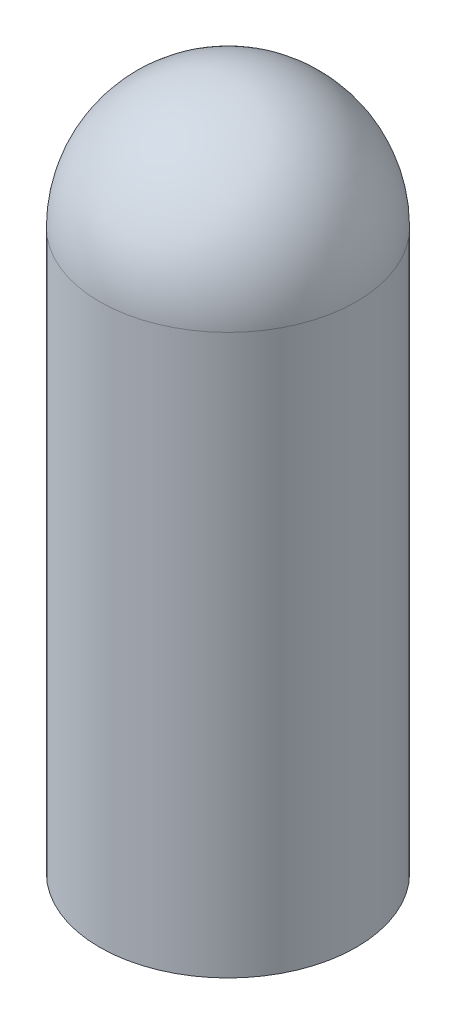
ISO-10303-21;
HEADER;
FILE_DESCRIPTION(('STEP AP214'),'2;1');
FILE_NAME('part.step','',(''),(''),'','','');
FILE_SCHEMA(('AUTOMOTIVE_DESIGN { 1 0 10303 214 1 1 1 1 }'));
ENDSEC;
DATA;
#1=APPLICATION_CONTEXT('core data for automotive mechanical design processes');
#2=APPLICATION_PROTOCOL_DEFINITION('international standard','automotive_design',2000,#1);
#3=PRODUCT_CONTEXT('',#1,'mechanical');
#4=PRODUCT('Part','Part','',(#3));
#5=PRODUCT_RELATED_PRODUCT_CATEGORY('part','',(#4));
#6=PRODUCT_DEFINITION_FORMATION('','',#4);
#7=PRODUCT_DEFINITION_CONTEXT('part definition',#1,'design');
#8=PRODUCT_DEFINITION('design','',#6,#7);
#9=PRODUCT_DEFINITION_SHAPE('','',#8);
#10=(LENGTH_UNIT() NAMED_UNIT(*) SI_UNIT(.MILLI.,.METRE.));
#11=(NAMED_UNIT(*) PLANE_ANGLE_UNIT() SI_UNIT($,.RADIAN.));
#12=(NAMED_UNIT(*) SI_UNIT($,.STERADIAN.) SOLID_ANGLE_UNIT());
#13=UNCERTAINTY_MEASURE_WITH_UNIT(LENGTH_MEASURE(1.E-05),#10,'distance_accuracy_value','');
#14=(GEOMETRIC_REPRESENTATION_CONTEXT(3) GLOBAL_UNCERTAINTY_ASSIGNED_CONTEXT((#13)) GLOBAL_UNIT_ASSIGNED_CONTEXT((#10,
#11,#12)) REPRESENTATION_CONTEXT('',''));
#15=CARTESIAN_POINT('',(0.,0.,0.));
#16=DIRECTION('',(0.,0.,1.));
#17=DIRECTION('',(1.,0.,0.));
#18=AXIS2_PLACEMENT_3D('',#15,#16,#17);
#19=CARTESIAN_POINT('',(-5.9309,0.,0.));
#20=DIRECTION('',(0.,-1.,0.));
#21=DIRECTION('',(0.,0.,-1.));
#22=AXIS2_PLACEMENT_3D('',#19,#20,#21);
#23=PLANE('',#22);
#24=CARTESIAN_POINT('',(0.,0.,0.));
#25=DIRECTION('',(0.,-1.,0.));
#26=DIRECTION('',(0.,0.,-1.));
#27=AXIS2_PLACEMENT_3D('',#24,#25,#26);
#28=CIRCLE('',#27,5.5499);
#29=CARTESIAN_POINT('',(0.,0.,-5.5499));
#30=VERTEX_POINT('',#29);
#31=EDGE_CURVE('E43',#30,#30,#28,.T.);
#32=ORIENTED_EDGE('',*,*,#31,.F.);
#33=EDGE_LOOP('',(#32));
#34=FACE_BOUND('',#33,.T.);
#35=CARTESIAN_POINT('',(0.,0.,0.));
#36=DIRECTION('',(0.,1.,0.));
#37=DIRECTION('',(0.,0.,1.));
#38=AXIS2_PLACEMENT_3D('',#35,#36,#37);
#39=CIRCLE('',#38,5.9309);
#40=CARTESIAN_POINT('',(0.,0.,5.9309));
#41=VERTEX_POINT('',#40);
#42=EDGE_CURVE('E10',#41,#41,#39,.T.);
#43=ORIENTED_EDGE('',*,*,#42,.F.);
#44=EDGE_LOOP('',(#43));
#45=FACE_BOUND('',#44,.T.);
#46=ADVANCED_FACE('F29',(#34,#45),#23,.T.);
#47=CARTESIAN_POINT('',(0.,0.,0.));
#48=DIRECTION('',(0.,1.,0.));
#49=DIRECTION('',(0.,0.,1.));
#50=AXIS2_PLACEMENT_3D('',#47,#48,#49);
#51=CYLINDRICAL_SURFACE('',#50,5.9309);
#52=ORIENTED_EDGE('',*,*,#42,.T.);
#53=EDGE_LOOP('',(#52));
#54=FACE_BOUND('',#53,.T.);
#55=CARTESIAN_POINT('',(0.,25.8191,0.));
#56=DIRECTION('',(0.,1.,0.));
#57=DIRECTION('',(0.,0.,1.));
#58=AXIS2_PLACEMENT_3D('',#55,#56,#57);
#59=CIRCLE('',#58,5.9309);
#60=CARTESIAN_POINT('',(0.,25.8191,5.9309));
#61=VERTEX_POINT('',#60);
#62=EDGE_CURVE('E35',#61,#61,#59,.T.);
#63=ORIENTED_EDGE('',*,*,#62,.F.);
#64=EDGE_LOOP('',(#63));
#65=FACE_BOUND('',#64,.T.);
#66=ADVANCED_FACE('F53',(#54,#65),#51,.T.);
#67=CARTESIAN_POINT('',(0.,25.8191,0.));
#68=DIRECTION('',(0.,1.,0.));
#69=DIRECTION('',(-1.,0.,0.));
#70=AXIS2_PLACEMENT_3D('',#67,#68,#69);
#71=SPHERICAL_SURFACE('',#70,5.9309);
#72=ORIENTED_EDGE('',*,*,#62,.T.);
#73=EDGE_LOOP('',(#72));
#74=FACE_BOUND('',#73,.T.);
#75=ADVANCED_FACE('F57',(#74),#71,.T.);
#76=CARTESIAN_POINT('',(0.,27.7749,0.));
#77=DIRECTION('',(0.,-1.,0.));
#78=DIRECTION('',(0.,0.,-1.));
#79=AXIS2_PLACEMENT_3D('',#76,#77,#78);
#80=CYLINDRICAL_SURFACE('',#79,5.5499);
#81=CARTESIAN_POINT('',(0.,27.7749,0.));
#82=DIRECTION('',(0.,-1.,0.));
#83=DIRECTION('',(0.,0.,-1.));
#84=AXIS2_PLACEMENT_3D('',#81,#82,#83);
#85=CIRCLE('',#84,5.5499);
#86=CARTESIAN_POINT('',(0.,27.7749,-5.5499));
#87=VERTEX_POINT('',#86);
#88=EDGE_CURVE('E39',#87,#87,#85,.T.);
#89=ORIENTED_EDGE('',*,*,#88,.F.);
#90=EDGE_LOOP('',(#89));
#91=FACE_BOUND('',#90,.T.);
#92=ORIENTED_EDGE('',*,*,#31,.T.);
#93=EDGE_LOOP('',(#92));
#94=FACE_BOUND('',#93,.T.);
#95=ADVANCED_FACE('F49',(#91,#94),#80,.F.);
#96=CARTESIAN_POINT('',(0.,27.7749,0.));
#97=DIRECTION('',(0.,-1.,0.));
#98=DIRECTION('',(0.,0.,-1.));
#99=AXIS2_PLACEMENT_3D('',#96,#97,#98);
#100=PLANE('',#99);
#101=ORIENTED_EDGE('',*,*,#88,.T.);
#102=EDGE_LOOP('',(#101));
#103=FACE_BOUND('',#102,.T.);
#104=ADVANCED_FACE('F66',(#103),#100,.T.);
#105=CLOSED_SHELL('',(#46,#66,#75,#95,#104));
#106=MANIFOLD_SOLID_BREP('B2',#105);
#107=ADVANCED_BREP_SHAPE_REPRESENTATION('',(#18,#106),#14);
#108=SHAPE_DEFINITION_REPRESENTATION(#9,#107);
ENDSEC;
END-ISO-10303-21;
